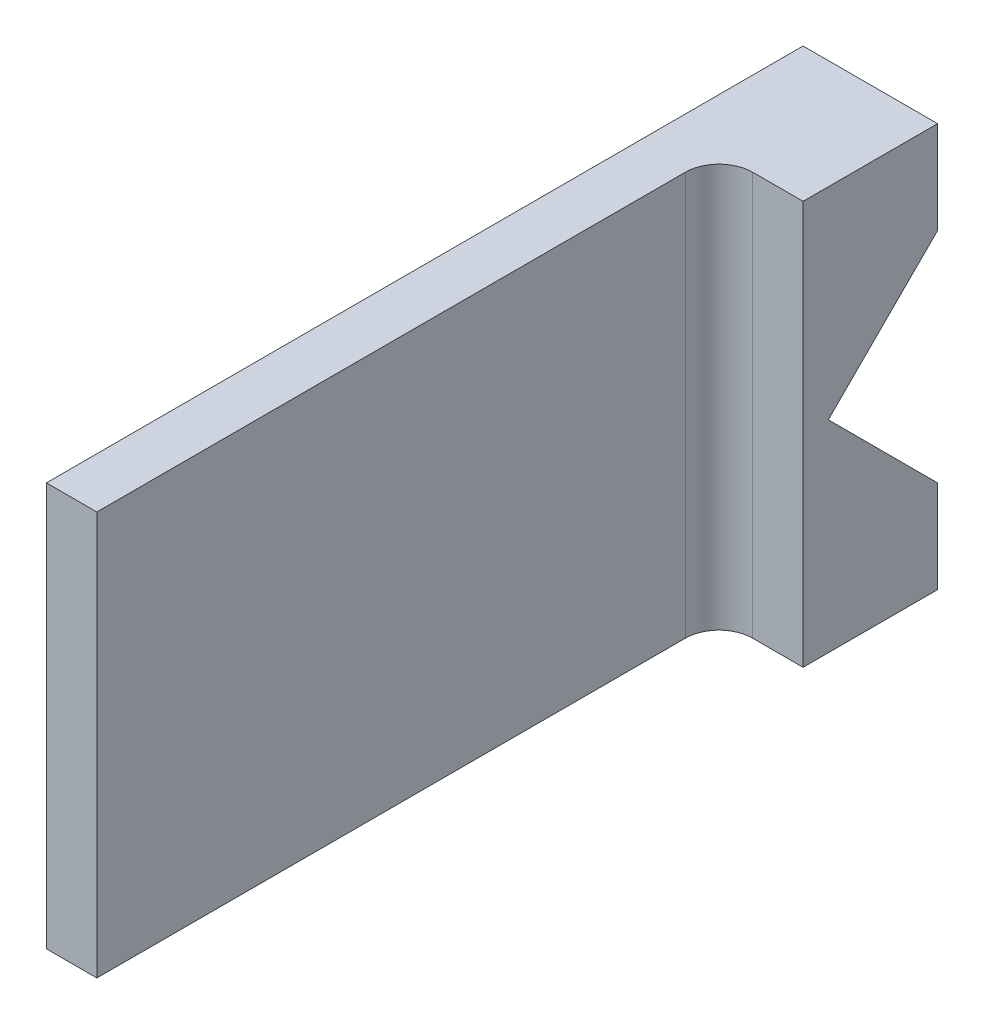
ISO-10303-21;
HEADER;
FILE_DESCRIPTION(('STEP AP214'),'2;1');
FILE_NAME('part.step','',(''),(''),'','','');
FILE_SCHEMA(('AUTOMOTIVE_DESIGN { 1 0 10303 214 1 1 1 1 }'));
ENDSEC;
DATA;
#1=APPLICATION_CONTEXT('core data for automotive mechanical design processes');
#2=APPLICATION_PROTOCOL_DEFINITION('international standard','automotive_design',2000,#1);
#3=PRODUCT_CONTEXT('',#1,'mechanical');
#4=PRODUCT('Part','Part','',(#3));
#5=PRODUCT_RELATED_PRODUCT_CATEGORY('part','',(#4));
#6=PRODUCT_DEFINITION_FORMATION('','',#4);
#7=PRODUCT_DEFINITION_CONTEXT('part definition',#1,'design');
#8=PRODUCT_DEFINITION('design','',#6,#7);
#9=PRODUCT_DEFINITION_SHAPE('','',#8);
#10=(LENGTH_UNIT() NAMED_UNIT(*) SI_UNIT(.MILLI.,.METRE.));
#11=(NAMED_UNIT(*) PLANE_ANGLE_UNIT() SI_UNIT($,.RADIAN.));
#12=(NAMED_UNIT(*) SI_UNIT($,.STERADIAN.) SOLID_ANGLE_UNIT());
#13=UNCERTAINTY_MEASURE_WITH_UNIT(LENGTH_MEASURE(1.E-05),#10,'distance_accuracy_value','');
#14=(GEOMETRIC_REPRESENTATION_CONTEXT(3) GLOBAL_UNCERTAINTY_ASSIGNED_CONTEXT((#13)) GLOBAL_UNIT_ASSIGNED_CONTEXT((#10,
#11,#12)) REPRESENTATION_CONTEXT('',''));
#15=CARTESIAN_POINT('',(0.,0.,0.));
#16=DIRECTION('',(0.,0.,1.));
#17=DIRECTION('',(1.,0.,0.));
#18=AXIS2_PLACEMENT_3D('',#15,#16,#17);
#19=CARTESIAN_POINT('',(12.7,0.,10.31875));
#20=DIRECTION('',(0.,0.707106781186547,0.707106781186548));
#21=DIRECTION('',(0.,-0.707106781186548,0.707106781186547));
#22=AXIS2_PLACEMENT_3D('',#19,#20,#21);
#23=PLANE('',#22);
#24=DIRECTION('',(0.,0.707106781186548,-0.707106781186547));
#25=VECTOR('',#24,1.);
#26=CARTESIAN_POINT('',(0.,0.,10.31875));
#27=LINE('',#26,#25);
#28=CARTESIAN_POINT('',(0.,0.,10.31875));
#29=VERTEX_POINT('',#28);
#30=CARTESIAN_POINT('',(0.,10.31875,0.));
#31=VERTEX_POINT('',#30);
#32=EDGE_CURVE('E126',#29,#31,#27,.T.);
#33=ORIENTED_EDGE('',*,*,#32,.T.);
#34=DIRECTION('',(-1.,0.,0.));
#35=VECTOR('',#34,1.);
#36=CARTESIAN_POINT('',(12.7,10.31875,0.));
#37=LINE('',#36,#35);
#38=CARTESIAN_POINT('',(12.7,10.31875,0.));
#39=VERTEX_POINT('',#38);
#40=EDGE_CURVE('E144',#39,#31,#37,.T.);
#41=ORIENTED_EDGE('',*,*,#40,.F.);
#42=DIRECTION('',(0.,0.707106781186548,-0.707106781186547));
#43=VECTOR('',#42,1.);
#44=CARTESIAN_POINT('',(12.7,0.,10.31875));
#45=LINE('',#44,#43);
#46=CARTESIAN_POINT('',(12.7,0.,10.31875));
#47=VERTEX_POINT('',#46);
#48=EDGE_CURVE('E158',#47,#39,#45,.T.);
#49=ORIENTED_EDGE('',*,*,#48,.F.);
#50=DIRECTION('',(-1.,0.,0.));
#51=VECTOR('',#50,1.);
#52=CARTESIAN_POINT('',(12.7,0.,10.31875));
#53=LINE('',#52,#51);
#54=EDGE_CURVE('E173',#47,#29,#53,.T.);
#55=ORIENTED_EDGE('',*,*,#54,.T.);
#56=EDGE_LOOP('',(#33,#41,#49,#55));
#57=FACE_BOUND('',#56,.T.);
#58=ADVANCED_FACE('F32',(#57),#23,.F.);
#59=CARTESIAN_POINT('',(12.7,19.05,0.));
#60=DIRECTION('',(0.,0.,1.));
#61=DIRECTION('',(0.,-1.,0.));
#62=AXIS2_PLACEMENT_3D('',#59,#60,#61);
#63=PLANE('',#62);
#64=DIRECTION('',(0.,1.,0.));
#65=VECTOR('',#64,1.);
#66=CARTESIAN_POINT('',(0.,19.05,0.));
#67=LINE('',#66,#65);
#68=CARTESIAN_POINT('',(0.,19.05,0.));
#69=VERTEX_POINT('',#68);
#70=EDGE_CURVE('E176',#31,#69,#67,.T.);
#71=ORIENTED_EDGE('',*,*,#70,.T.);
#72=DIRECTION('',(-1.,0.,0.));
#73=VECTOR('',#72,1.);
#74=CARTESIAN_POINT('',(12.7,19.05,0.));
#75=LINE('',#74,#73);
#76=CARTESIAN_POINT('',(12.7,19.05,0.));
#77=VERTEX_POINT('',#76);
#78=EDGE_CURVE('E135',#77,#69,#75,.T.);
#79=ORIENTED_EDGE('',*,*,#78,.F.);
#80=DIRECTION('',(0.,1.,0.));
#81=VECTOR('',#80,1.);
#82=CARTESIAN_POINT('',(12.7,19.05,0.));
#83=LINE('',#82,#81);
#84=EDGE_CURVE('E161',#39,#77,#83,.T.);
#85=ORIENTED_EDGE('',*,*,#84,.F.);
#86=ORIENTED_EDGE('',*,*,#40,.T.);
#87=EDGE_LOOP('',(#71,#79,#85,#86));
#88=FACE_BOUND('',#87,.T.);
#89=ADVANCED_FACE('F213',(#88),#63,.F.);
#90=CARTESIAN_POINT('',(12.7,19.05,71.4375));
#91=DIRECTION('',(0.,-1.,0.));
#92=DIRECTION('',(0.,0.,-1.));
#93=AXIS2_PLACEMENT_3D('',#90,#91,#92);
#94=PLANE('',#93);
#95=DIRECTION('',(-1.,0.,0.));
#96=VECTOR('',#95,1.);
#97=CARTESIAN_POINT('',(12.7,19.05,71.4375));
#98=LINE('',#97,#96);
#99=CARTESIAN_POINT('',(4.76250000000001,19.05,71.4375));
#100=VERTEX_POINT('',#99);
#101=CARTESIAN_POINT('',(0.,19.05,71.4375));
#102=VERTEX_POINT('',#101);
#103=EDGE_CURVE('E132',#100,#102,#98,.T.);
#104=ORIENTED_EDGE('',*,*,#103,.F.);
#105=DIRECTION('',(0.,0.,1.));
#106=VECTOR('',#105,1.);
#107=CARTESIAN_POINT('',(4.7625,19.05,12.7));
#108=LINE('',#107,#106);
#109=CARTESIAN_POINT('',(4.7625,19.05,15.875));
#110=VERTEX_POINT('',#109);
#111=EDGE_CURVE('E123',#110,#100,#108,.T.);
#112=ORIENTED_EDGE('',*,*,#111,.F.);
#113=CARTESIAN_POINT('',(7.9375,19.05,15.875));
#114=DIRECTION('',(0.,-1.,0.));
#115=DIRECTION('',(0.,0.,-1.));
#116=AXIS2_PLACEMENT_3D('',#113,#114,#115);
#117=CIRCLE('',#116,3.175);
#118=CARTESIAN_POINT('',(7.9375,19.05,12.7));
#119=VERTEX_POINT('',#118);
#120=EDGE_CURVE('E40',#110,#119,#117,.T.);
#121=ORIENTED_EDGE('',*,*,#120,.T.);
#122=DIRECTION('',(-1.,0.,0.));
#123=VECTOR('',#122,1.);
#124=CARTESIAN_POINT('',(12.7,19.05,12.7));
#125=LINE('',#124,#123);
#126=CARTESIAN_POINT('',(12.7,19.05,12.7));
#127=VERTEX_POINT('',#126);
#128=EDGE_CURVE('E152',#127,#119,#125,.T.);
#129=ORIENTED_EDGE('',*,*,#128,.F.);
#130=DIRECTION('',(0.,0.,1.));
#131=VECTOR('',#130,1.);
#132=CARTESIAN_POINT('',(12.7,19.05,71.4375));
#133=LINE('',#132,#131);
#134=EDGE_CURVE('E164',#77,#127,#133,.T.);
#135=ORIENTED_EDGE('',*,*,#134,.F.);
#136=ORIENTED_EDGE('',*,*,#78,.T.);
#137=DIRECTION('',(0.,0.,1.));
#138=VECTOR('',#137,1.);
#139=CARTESIAN_POINT('',(0.,19.05,71.4375));
#140=LINE('',#139,#138);
#141=EDGE_CURVE('E178',#69,#102,#140,.T.);
#142=ORIENTED_EDGE('',*,*,#141,.T.);
#143=EDGE_LOOP('',(#104,#112,#121,#129,#135,#136,#142));
#144=FACE_BOUND('',#143,.T.);
#145=ADVANCED_FACE('F150',(#144),#94,.F.);
#146=CARTESIAN_POINT('',(12.7,-19.05,71.4375));
#147=DIRECTION('',(0.,0.,-1.));
#148=DIRECTION('',(-1.,0.,0.));
#149=AXIS2_PLACEMENT_3D('',#146,#147,#148);
#150=PLANE('',#149);
#151=DIRECTION('',(-1.,0.,0.));
#152=VECTOR('',#151,1.);
#153=CARTESIAN_POINT('',(12.7,-19.05,71.4375));
#154=LINE('',#153,#152);
#155=CARTESIAN_POINT('',(4.76250000000001,-19.05,71.4375));
#156=VERTEX_POINT('',#155);
#157=CARTESIAN_POINT('',(0.,-19.05,71.4375));
#158=VERTEX_POINT('',#157);
#159=EDGE_CURVE('E111',#156,#158,#154,.T.);
#160=ORIENTED_EDGE('',*,*,#159,.F.);
#161=DIRECTION('',(0.,1.,0.));
#162=VECTOR('',#161,1.);
#163=CARTESIAN_POINT('',(4.76250000000001,-19.05,71.4375));
#164=LINE('',#163,#162);
#165=EDGE_CURVE('E121',#156,#100,#164,.T.);
#166=ORIENTED_EDGE('',*,*,#165,.T.);
#167=ORIENTED_EDGE('',*,*,#103,.T.);
#168=DIRECTION('',(0.,-1.,0.));
#169=VECTOR('',#168,1.);
#170=CARTESIAN_POINT('',(0.,-19.05,71.4375));
#171=LINE('',#170,#169);
#172=EDGE_CURVE('E130',#102,#158,#171,.T.);
#173=ORIENTED_EDGE('',*,*,#172,.T.);
#174=EDGE_LOOP('',(#160,#166,#167,#173));
#175=FACE_BOUND('',#174,.T.);
#176=ADVANCED_FACE('F128',(#175),#150,.F.);
#177=CARTESIAN_POINT('',(12.7,-19.05,0.));
#178=DIRECTION('',(0.,1.,0.));
#179=DIRECTION('',(0.,0.,1.));
#180=AXIS2_PLACEMENT_3D('',#177,#178,#179);
#181=PLANE('',#180);
#182=DIRECTION('',(-1.,0.,0.));
#183=VECTOR('',#182,1.);
#184=CARTESIAN_POINT('',(12.7,-19.05,12.7));
#185=LINE('',#184,#183);
#186=CARTESIAN_POINT('',(12.7,-19.05,12.7));
#187=VERTEX_POINT('',#186);
#188=CARTESIAN_POINT('',(7.9375,-19.05,12.7));
#189=VERTEX_POINT('',#188);
#190=EDGE_CURVE('E118',#187,#189,#185,.T.);
#191=ORIENTED_EDGE('',*,*,#190,.T.);
#192=CARTESIAN_POINT('',(7.9375,-19.05,15.875));
#193=DIRECTION('',(0.,1.,0.));
#194=DIRECTION('',(0.,0.,1.));
#195=AXIS2_PLACEMENT_3D('',#192,#193,#194);
#196=CIRCLE('',#195,3.175);
#197=CARTESIAN_POINT('',(4.7625,-19.05,15.875));
#198=VERTEX_POINT('',#197);
#199=EDGE_CURVE('E11',#189,#198,#196,.T.);
#200=ORIENTED_EDGE('',*,*,#199,.T.);
#201=DIRECTION('',(0.,0.,1.));
#202=VECTOR('',#201,1.);
#203=CARTESIAN_POINT('',(4.7625,-19.05,12.7));
#204=LINE('',#203,#202);
#205=EDGE_CURVE('E107',#198,#156,#204,.T.);
#206=ORIENTED_EDGE('',*,*,#205,.T.);
#207=ORIENTED_EDGE('',*,*,#159,.T.);
#208=DIRECTION('',(0.,0.,-1.));
#209=VECTOR('',#208,1.);
#210=CARTESIAN_POINT('',(0.,-19.05,0.));
#211=LINE('',#210,#209);
#212=CARTESIAN_POINT('',(0.,-19.05,0.));
#213=VERTEX_POINT('',#212);
#214=EDGE_CURVE('E181',#158,#213,#211,.T.);
#215=ORIENTED_EDGE('',*,*,#214,.T.);
#216=DIRECTION('',(-1.,0.,0.));
#217=VECTOR('',#216,1.);
#218=CARTESIAN_POINT('',(12.7,-19.05,0.));
#219=LINE('',#218,#217);
#220=CARTESIAN_POINT('',(12.7,-19.05,0.));
#221=VERTEX_POINT('',#220);
#222=EDGE_CURVE('E133',#221,#213,#219,.T.);
#223=ORIENTED_EDGE('',*,*,#222,.F.);
#224=DIRECTION('',(0.,0.,-1.));
#225=VECTOR('',#224,1.);
#226=CARTESIAN_POINT('',(12.7,-19.05,0.));
#227=LINE('',#226,#225);
#228=EDGE_CURVE('E167',#187,#221,#227,.T.);
#229=ORIENTED_EDGE('',*,*,#228,.F.);
#230=EDGE_LOOP('',(#191,#200,#206,#207,#215,#223,#229));
#231=FACE_BOUND('',#230,.T.);
#232=ADVANCED_FACE('F109',(#231),#181,.F.);
#233=CARTESIAN_POINT('',(12.7,-10.31875,0.));
#234=DIRECTION('',(0.,0.,1.));
#235=DIRECTION('',(0.,-1.,0.));
#236=AXIS2_PLACEMENT_3D('',#233,#234,#235);
#237=PLANE('',#236);
#238=DIRECTION('',(0.,1.,0.));
#239=VECTOR('',#238,1.);
#240=CARTESIAN_POINT('',(0.,-10.31875,0.));
#241=LINE('',#240,#239);
#242=CARTESIAN_POINT('',(0.,-10.31875,0.));
#243=VERTEX_POINT('',#242);
#244=EDGE_CURVE('E183',#213,#243,#241,.T.);
#245=ORIENTED_EDGE('',*,*,#244,.T.);
#246=DIRECTION('',(-1.,0.,0.));
#247=VECTOR('',#246,1.);
#248=CARTESIAN_POINT('',(12.7,-10.31875,0.));
#249=LINE('',#248,#247);
#250=CARTESIAN_POINT('',(12.7,-10.31875,0.));
#251=VERTEX_POINT('',#250);
#252=EDGE_CURVE('E138',#251,#243,#249,.T.);
#253=ORIENTED_EDGE('',*,*,#252,.F.);
#254=DIRECTION('',(0.,1.,0.));
#255=VECTOR('',#254,1.);
#256=CARTESIAN_POINT('',(12.7,-10.31875,0.));
#257=LINE('',#256,#255);
#258=EDGE_CURVE('E169',#221,#251,#257,.T.);
#259=ORIENTED_EDGE('',*,*,#258,.F.);
#260=ORIENTED_EDGE('',*,*,#222,.T.);
#261=EDGE_LOOP('',(#245,#253,#259,#260));
#262=FACE_BOUND('',#261,.T.);
#263=ADVANCED_FACE('F210',(#262),#237,.F.);
#264=CARTESIAN_POINT('',(12.7,-10.31875,0.));
#265=DIRECTION('',(0.,-0.707106781186548,0.707106781186547));
#266=DIRECTION('',(0.,-0.707106781186547,-0.707106781186548));
#267=AXIS2_PLACEMENT_3D('',#264,#265,#266);
#268=PLANE('',#267);
#269=DIRECTION('',(0.,0.707106781186548,0.707106781186548));
#270=VECTOR('',#269,1.);
#271=CARTESIAN_POINT('',(0.,-10.31875,0.));
#272=LINE('',#271,#270);
#273=EDGE_CURVE('E162',#243,#29,#272,.T.);
#274=ORIENTED_EDGE('',*,*,#273,.T.);
#275=ORIENTED_EDGE('',*,*,#54,.F.);
#276=DIRECTION('',(0.,0.707106781186548,0.707106781186548));
#277=VECTOR('',#276,1.);
#278=CARTESIAN_POINT('',(12.7,-10.31875,0.));
#279=LINE('',#278,#277);
#280=EDGE_CURVE('E171',#251,#47,#279,.T.);
#281=ORIENTED_EDGE('',*,*,#280,.F.);
#282=ORIENTED_EDGE('',*,*,#252,.T.);
#283=EDGE_LOOP('',(#274,#275,#281,#282));
#284=FACE_BOUND('',#283,.T.);
#285=ADVANCED_FACE('F192',(#284),#268,.F.);
#286=CARTESIAN_POINT('',(12.7,0.,0.));
#287=DIRECTION('',(1.,0.,0.));
#288=DIRECTION('',(0.,0.,-1.));
#289=AXIS2_PLACEMENT_3D('',#286,#287,#288);
#290=PLANE('',#289);
#291=DIRECTION('',(0.,1.,0.));
#292=VECTOR('',#291,1.);
#293=CARTESIAN_POINT('',(12.7,-19.05,12.7));
#294=LINE('',#293,#292);
#295=EDGE_CURVE('E117',#187,#127,#294,.T.);
#296=ORIENTED_EDGE('',*,*,#295,.F.);
#297=ORIENTED_EDGE('',*,*,#228,.T.);
#298=ORIENTED_EDGE('',*,*,#258,.T.);
#299=ORIENTED_EDGE('',*,*,#280,.T.);
#300=ORIENTED_EDGE('',*,*,#48,.T.);
#301=ORIENTED_EDGE('',*,*,#84,.T.);
#302=ORIENTED_EDGE('',*,*,#134,.T.);
#303=EDGE_LOOP('',(#296,#297,#298,#299,#300,#301,#302));
#304=FACE_BOUND('',#303,.T.);
#305=ADVANCED_FACE('F206',(#304),#290,.T.);
#306=CARTESIAN_POINT('',(0.,0.,0.));
#307=DIRECTION('',(1.,0.,0.));
#308=DIRECTION('',(0.,0.,-1.));
#309=AXIS2_PLACEMENT_3D('',#306,#307,#308);
#310=PLANE('',#309);
#311=ORIENTED_EDGE('',*,*,#32,.F.);
#312=ORIENTED_EDGE('',*,*,#273,.F.);
#313=ORIENTED_EDGE('',*,*,#244,.F.);
#314=ORIENTED_EDGE('',*,*,#214,.F.);
#315=ORIENTED_EDGE('',*,*,#172,.F.);
#316=ORIENTED_EDGE('',*,*,#141,.F.);
#317=ORIENTED_EDGE('',*,*,#70,.F.);
#318=EDGE_LOOP('',(#311,#312,#313,#314,#315,#316,#317));
#319=FACE_BOUND('',#318,.T.);
#320=ADVANCED_FACE('F199',(#319),#310,.F.);
#321=CARTESIAN_POINT('',(4.7625,-19.05,12.7));
#322=DIRECTION('',(-1.,0.,0.));
#323=DIRECTION('',(0.,0.,1.));
#324=AXIS2_PLACEMENT_3D('',#321,#322,#323);
#325=PLANE('',#324);
#326=ORIENTED_EDGE('',*,*,#205,.F.);
#327=DIRECTION('',(0.,1.,0.));
#328=VECTOR('',#327,1.);
#329=CARTESIAN_POINT('',(4.7625,19.05,15.875));
#330=LINE('',#329,#328);
#331=EDGE_CURVE('E147',#198,#110,#330,.T.);
#332=ORIENTED_EDGE('',*,*,#331,.T.);
#333=ORIENTED_EDGE('',*,*,#111,.T.);
#334=ORIENTED_EDGE('',*,*,#165,.F.);
#335=EDGE_LOOP('',(#326,#332,#333,#334));
#336=FACE_BOUND('',#335,.T.);
#337=ADVANCED_FACE('F122',(#336),#325,.F.);
#338=CARTESIAN_POINT('',(12.7,-19.05,12.7));
#339=DIRECTION('',(0.,0.,-1.));
#340=DIRECTION('',(0.,1.,0.));
#341=AXIS2_PLACEMENT_3D('',#338,#339,#340);
#342=PLANE('',#341);
#343=ORIENTED_EDGE('',*,*,#128,.T.);
#344=DIRECTION('',(0.,1.,0.));
#345=VECTOR('',#344,1.);
#346=CARTESIAN_POINT('',(7.9375,-19.05,12.7));
#347=LINE('',#346,#345);
#348=EDGE_CURVE('E47',#119,#189,#347,.F.);
#349=ORIENTED_EDGE('',*,*,#348,.T.);
#350=ORIENTED_EDGE('',*,*,#190,.F.);
#351=ORIENTED_EDGE('',*,*,#295,.T.);
#352=EDGE_LOOP('',(#343,#349,#350,#351));
#353=FACE_BOUND('',#352,.T.);
#354=ADVANCED_FACE('F234',(#353),#342,.F.);
#355=CARTESIAN_POINT('',(7.9375,-19.05,15.875));
#356=DIRECTION('',(0.,-1.,0.));
#357=DIRECTION('',(0.,0.,-1.));
#358=AXIS2_PLACEMENT_3D('',#355,#356,#357);
#359=CYLINDRICAL_SURFACE('',#358,3.175);
#360=ORIENTED_EDGE('',*,*,#199,.F.);
#361=ORIENTED_EDGE('',*,*,#348,.F.);
#362=ORIENTED_EDGE('',*,*,#120,.F.);
#363=ORIENTED_EDGE('',*,*,#331,.F.);
#364=EDGE_LOOP('',(#360,#361,#362,#363));
#365=FACE_BOUND('',#364,.T.);
#366=ADVANCED_FACE('F34',(#365),#359,.F.);
#367=CLOSED_SHELL('',(#58,#89,#145,#176,#232,#263,#285,#305,#320,#337,#354,#366));
#368=MANIFOLD_SOLID_BREP('B2',#367);
#369=ADVANCED_BREP_SHAPE_REPRESENTATION('',(#18,#368),#14);
#370=SHAPE_DEFINITION_REPRESENTATION(#9,#369);
ENDSEC;
END-ISO-10303-21;
